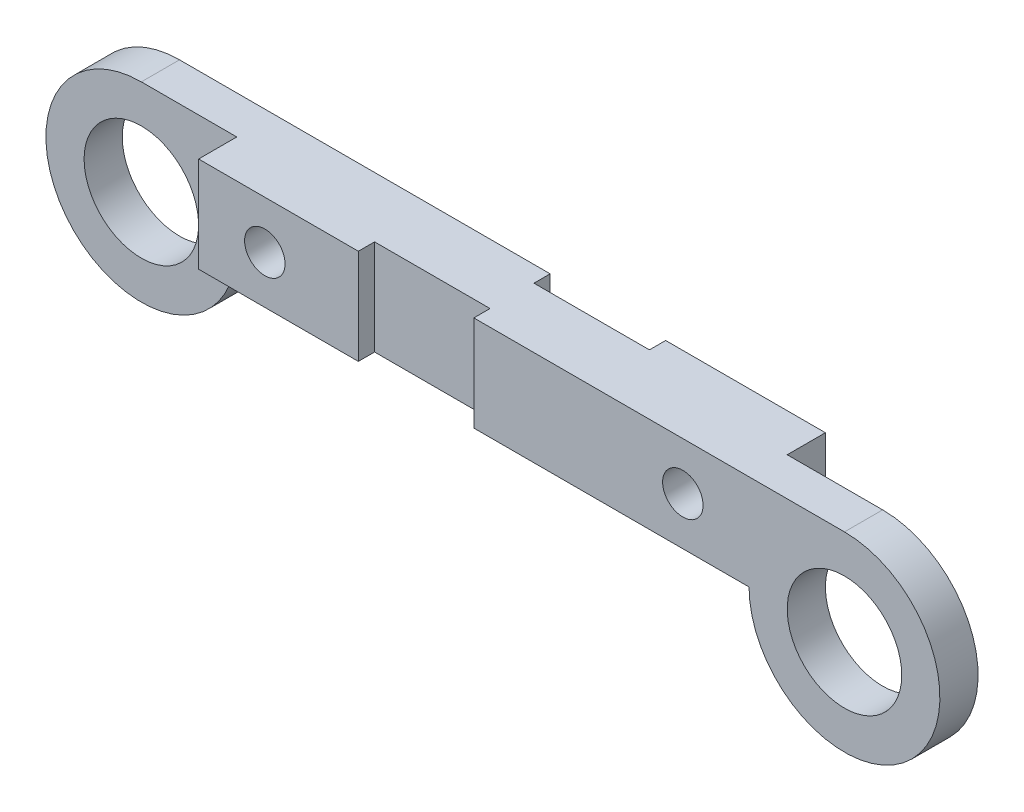
ISO-10303-21;
HEADER;
FILE_DESCRIPTION(('STEP AP214'),'2;1');
FILE_NAME('part.step','',(''),(''),'','','');
FILE_SCHEMA(('AUTOMOTIVE_DESIGN { 1 0 10303 214 1 1 1 1 }'));
ENDSEC;
DATA;
#1=APPLICATION_CONTEXT('core data for automotive mechanical design processes');
#2=APPLICATION_PROTOCOL_DEFINITION('international standard','automotive_design',2000,#1);
#3=PRODUCT_CONTEXT('',#1,'mechanical');
#4=PRODUCT('Part','Part','',(#3));
#5=PRODUCT_RELATED_PRODUCT_CATEGORY('part','',(#4));
#6=PRODUCT_DEFINITION_FORMATION('','',#4);
#7=PRODUCT_DEFINITION_CONTEXT('part definition',#1,'design');
#8=PRODUCT_DEFINITION('design','',#6,#7);
#9=PRODUCT_DEFINITION_SHAPE('','',#8);
#10=(LENGTH_UNIT() NAMED_UNIT(*) SI_UNIT(.MILLI.,.METRE.));
#11=(NAMED_UNIT(*) PLANE_ANGLE_UNIT() SI_UNIT($,.RADIAN.));
#12=(NAMED_UNIT(*) SI_UNIT($,.STERADIAN.) SOLID_ANGLE_UNIT());
#13=UNCERTAINTY_MEASURE_WITH_UNIT(LENGTH_MEASURE(1.E-05),#10,'distance_accuracy_value','');
#14=(GEOMETRIC_REPRESENTATION_CONTEXT(3) GLOBAL_UNCERTAINTY_ASSIGNED_CONTEXT((#13)) GLOBAL_UNIT_ASSIGNED_CONTEXT((#10,
#11,#12)) REPRESENTATION_CONTEXT('',''));
#15=CARTESIAN_POINT('',(0.,0.,0.));
#16=DIRECTION('',(0.,0.,1.));
#17=DIRECTION('',(1.,0.,0.));
#18=AXIS2_PLACEMENT_3D('',#15,#16,#17);
#19=CARTESIAN_POINT('',(-97.1,-25.,0.));
#20=DIRECTION('',(0.,0.,1.));
#21=DIRECTION('',(1.,0.,0.));
#22=AXIS2_PLACEMENT_3D('',#19,#20,#21);
#23=PLANE('',#22);
#24=CARTESIAN_POINT('',(-97.1,-25.,0.));
#25=DIRECTION('',(0.,0.,1.));
#26=DIRECTION('',(1.,0.,0.));
#27=AXIS2_PLACEMENT_3D('',#24,#25,#26);
#28=CIRCLE('',#27,15.);
#29=CARTESIAN_POINT('',(-82.1,-25.,0.));
#30=VERTEX_POINT('',#29);
#31=EDGE_CURVE('E255',#30,#30,#28,.T.);
#32=ORIENTED_EDGE('',*,*,#31,.T.);
#33=EDGE_LOOP('',(#32));
#34=FACE_BOUND('',#33,.T.);
#35=CARTESIAN_POINT('',(-54.7549646169727,-12.5,0.));
#36=DIRECTION('',(0.,0.,1.));
#37=DIRECTION('',(1.,0.,0.));
#38=AXIS2_PLACEMENT_3D('',#35,#36,#37);
#39=CIRCLE('',#38,5.29788538285587);
#40=CARTESIAN_POINT('',(-49.4570792341168,-12.5,0.));
#41=VERTEX_POINT('',#40);
#42=EDGE_CURVE('E220',#41,#41,#39,.F.);
#43=ORIENTED_EDGE('',*,*,#42,.F.);
#44=EDGE_LOOP('',(#43));
#45=FACE_BOUND('',#44,.T.);
#46=DIRECTION('',(-1.,0.,0.));
#47=VECTOR('',#46,1.);
#48=CARTESIAN_POINT('',(-97.1,0.,0.));
#49=LINE('',#48,#47);
#50=CARTESIAN_POINT('',(0.,0.,0.));
#51=VERTEX_POINT('',#50);
#52=CARTESIAN_POINT('',(-97.1,0.,0.));
#53=VERTEX_POINT('',#52);
#54=EDGE_CURVE('E276',#51,#53,#49,.T.);
#55=ORIENTED_EDGE('',*,*,#54,.F.);
#56=DIRECTION('',(0.,1.,0.));
#57=VECTOR('',#56,1.);
#58=CARTESIAN_POINT('',(0.,-31.,0.));
#59=LINE('',#58,#57);
#60=CARTESIAN_POINT('',(0.,-25.,0.));
#61=VERTEX_POINT('',#60);
#62=EDGE_CURVE('E178',#61,#51,#59,.T.);
#63=ORIENTED_EDGE('',*,*,#62,.F.);
#64=DIRECTION('',(1.,0.,0.));
#65=VECTOR('',#64,1.);
#66=CARTESIAN_POINT('',(-72.1,-25.,0.));
#67=LINE('',#66,#65);
#68=CARTESIAN_POINT('',(-72.1,-25.,0.));
#69=VERTEX_POINT('',#68);
#70=EDGE_CURVE('E273',#69,#61,#67,.T.);
#71=ORIENTED_EDGE('',*,*,#70,.F.);
#72=CARTESIAN_POINT('',(-97.1,-25.,0.));
#73=DIRECTION('',(0.,0.,1.));
#74=DIRECTION('',(1.,0.,0.));
#75=AXIS2_PLACEMENT_3D('',#72,#73,#74);
#76=CIRCLE('',#75,25.);
#77=EDGE_CURVE('E258',#53,#69,#76,.T.);
#78=ORIENTED_EDGE('',*,*,#77,.F.);
#79=EDGE_LOOP('',(#55,#63,#71,#78));
#80=FACE_BOUND('',#79,.T.);
#81=ADVANCED_FACE('F41',(#34,#45,#80),#23,.F.);
#82=CARTESIAN_POINT('',(-97.1,-25.,20.));
#83=DIRECTION('',(0.,0.,1.));
#84=DIRECTION('',(1.,0.,0.));
#85=AXIS2_PLACEMENT_3D('',#82,#83,#84);
#86=PLANE('',#85);
#87=DIRECTION('',(0.,1.,0.));
#88=VECTOR('',#87,1.);
#89=CARTESIAN_POINT('',(-30.2527430075511,-31.,20.));
#90=LINE('',#89,#88);
#91=CARTESIAN_POINT('',(-30.2527430075511,-25.,20.));
#92=VERTEX_POINT('',#91);
#93=CARTESIAN_POINT('',(-30.2527430075511,0.,20.));
#94=VERTEX_POINT('',#93);
#95=EDGE_CURVE('E194',#92,#94,#90,.T.);
#96=ORIENTED_EDGE('',*,*,#95,.T.);
#97=DIRECTION('',(-1.,0.,0.));
#98=VECTOR('',#97,1.);
#99=CARTESIAN_POINT('',(-97.1,0.,20.));
#100=LINE('',#99,#98);
#101=CARTESIAN_POINT('',(-72.1,0.,20.));
#102=VERTEX_POINT('',#101);
#103=EDGE_CURVE('E265',#94,#102,#100,.T.);
#104=ORIENTED_EDGE('',*,*,#103,.T.);
#105=DIRECTION('',(0.,1.,0.));
#106=VECTOR('',#105,1.);
#107=CARTESIAN_POINT('',(-72.1,-84.,20.));
#108=LINE('',#107,#106);
#109=CARTESIAN_POINT('',(-72.1,-25.,20.));
#110=VERTEX_POINT('',#109);
#111=EDGE_CURVE('E244',#110,#102,#108,.T.);
#112=ORIENTED_EDGE('',*,*,#111,.F.);
#113=DIRECTION('',(1.,0.,0.));
#114=VECTOR('',#113,1.);
#115=CARTESIAN_POINT('',(-72.1,-25.,20.));
#116=LINE('',#115,#114);
#117=EDGE_CURVE('E259',#110,#92,#116,.T.);
#118=ORIENTED_EDGE('',*,*,#117,.T.);
#119=EDGE_LOOP('',(#96,#104,#112,#118));
#120=FACE_BOUND('',#119,.T.);
#121=CARTESIAN_POINT('',(-54.7549646169727,-12.5,20.));
#122=DIRECTION('',(0.,0.,1.));
#123=DIRECTION('',(1.,0.,0.));
#124=AXIS2_PLACEMENT_3D('',#121,#122,#123);
#125=CIRCLE('',#124,5.29788538285587);
#126=CARTESIAN_POINT('',(-49.4570792341168,-12.5,20.));
#127=VERTEX_POINT('',#126);
#128=EDGE_CURVE('E217',#127,#127,#125,.T.);
#129=ORIENTED_EDGE('',*,*,#128,.F.);
#130=EDGE_LOOP('',(#129));
#131=FACE_BOUND('',#130,.T.);
#132=ADVANCED_FACE('F300',(#120,#131),#86,.T.);
#133=DIRECTION('',(0.,1.,0.));
#134=VECTOR('',#133,1.);
#135=CARTESIAN_POINT('',(0.,-31.,20.));
#136=LINE('',#135,#134);
#137=CARTESIAN_POINT('',(0.,-25.,20.));
#138=VERTEX_POINT('',#137);
#139=CARTESIAN_POINT('',(0.,0.,20.));
#140=VERTEX_POINT('',#139);
#141=EDGE_CURVE('E66',#138,#140,#136,.T.);
#142=ORIENTED_EDGE('',*,*,#141,.F.);
#143=CARTESIAN_POINT('',(72.1,-25.,20.));
#144=VERTEX_POINT('',#143);
#145=EDGE_CURVE('E263',#138,#144,#116,.T.);
#146=ORIENTED_EDGE('',*,*,#145,.T.);
#147=CARTESIAN_POINT('',(97.1,-25.,20.));
#148=DIRECTION('',(0.,0.,1.));
#149=DIRECTION('',(1.,0.,0.));
#150=AXIS2_PLACEMENT_3D('',#147,#148,#149);
#151=CIRCLE('',#150,25.);
#152=CARTESIAN_POINT('',(97.1,0.,20.));
#153=VERTEX_POINT('',#152);
#154=EDGE_CURVE('E262',#144,#153,#151,.T.);
#155=ORIENTED_EDGE('',*,*,#154,.T.);
#156=EDGE_CURVE('E266',#153,#140,#100,.T.);
#157=ORIENTED_EDGE('',*,*,#156,.T.);
#158=EDGE_LOOP('',(#142,#146,#155,#157));
#159=FACE_BOUND('',#158,.T.);
#160=CARTESIAN_POINT('',(54.7549646169727,-12.5,20.));
#161=DIRECTION('',(0.,0.,1.));
#162=DIRECTION('',(-1.,0.,0.));
#163=AXIS2_PLACEMENT_3D('',#160,#161,#162);
#164=CIRCLE('',#163,5.29788538285587);
#165=CARTESIAN_POINT('',(49.4570792341168,-12.5,20.));
#166=VERTEX_POINT('',#165);
#167=EDGE_CURVE('E211',#166,#166,#164,.T.);
#168=ORIENTED_EDGE('',*,*,#167,.F.);
#169=EDGE_LOOP('',(#168));
#170=FACE_BOUND('',#169,.T.);
#171=CARTESIAN_POINT('',(97.1,-25.,20.));
#172=DIRECTION('',(0.,0.,1.));
#173=DIRECTION('',(1.,0.,0.));
#174=AXIS2_PLACEMENT_3D('',#171,#172,#173);
#175=CIRCLE('',#174,15.);
#176=CARTESIAN_POINT('',(112.1,-25.,20.));
#177=VERTEX_POINT('',#176);
#178=EDGE_CURVE('E252',#177,#177,#175,.T.);
#179=ORIENTED_EDGE('',*,*,#178,.F.);
#180=EDGE_LOOP('',(#179));
#181=FACE_BOUND('',#180,.T.);
#182=ADVANCED_FACE('F334',(#159,#170,#181),#86,.T.);
#183=CARTESIAN_POINT('',(54.7549646169727,-12.5,0.));
#184=DIRECTION('',(0.,0.,1.));
#185=DIRECTION('',(1.,0.,0.));
#186=AXIS2_PLACEMENT_3D('',#183,#184,#185);
#187=CIRCLE('',#186,5.29788538285587);
#188=CARTESIAN_POINT('',(60.0528499998286,-12.5,0.));
#189=VERTEX_POINT('',#188);
#190=EDGE_CURVE('E214',#189,#189,#187,.F.);
#191=ORIENTED_EDGE('',*,*,#190,.F.);
#192=EDGE_LOOP('',(#191));
#193=FACE_BOUND('',#192,.T.);
#194=CARTESIAN_POINT('',(30.2527430075511,-25.,0.));
#195=VERTEX_POINT('',#194);
#196=CARTESIAN_POINT('',(72.1,-25.,0.));
#197=VERTEX_POINT('',#196);
#198=EDGE_CURVE('E272',#195,#197,#67,.T.);
#199=ORIENTED_EDGE('',*,*,#198,.F.);
#200=DIRECTION('',(0.,1.,0.));
#201=VECTOR('',#200,1.);
#202=CARTESIAN_POINT('',(30.2527430075511,-31.,0.));
#203=LINE('',#202,#201);
#204=CARTESIAN_POINT('',(30.2527430075511,0.,0.));
#205=VERTEX_POINT('',#204);
#206=EDGE_CURVE('E161',#195,#205,#203,.T.);
#207=ORIENTED_EDGE('',*,*,#206,.T.);
#208=CARTESIAN_POINT('',(72.1,0.,0.));
#209=VERTEX_POINT('',#208);
#210=EDGE_CURVE('E173',#209,#205,#49,.T.);
#211=ORIENTED_EDGE('',*,*,#210,.F.);
#212=DIRECTION('',(0.,1.,0.));
#213=VECTOR('',#212,1.);
#214=CARTESIAN_POINT('',(72.1,-84.,0.));
#215=LINE('',#214,#213);
#216=EDGE_CURVE('E229',#197,#209,#215,.T.);
#217=ORIENTED_EDGE('',*,*,#216,.F.);
#218=EDGE_LOOP('',(#199,#207,#211,#217));
#219=FACE_BOUND('',#218,.T.);
#220=ADVANCED_FACE('F302',(#193,#219),#23,.F.);
#221=CARTESIAN_POINT('',(-97.1,-25.,20.));
#222=DIRECTION('',(0.,0.,-1.));
#223=DIRECTION('',(-1.,0.,0.));
#224=AXIS2_PLACEMENT_3D('',#221,#222,#223);
#225=CYLINDRICAL_SURFACE('',#224,25.);
#226=CARTESIAN_POINT('',(-97.1,-25.,10.));
#227=DIRECTION('',(0.,0.,-1.));
#228=DIRECTION('',(-1.,0.,0.));
#229=AXIS2_PLACEMENT_3D('',#226,#227,#228);
#230=CIRCLE('',#229,25.);
#231=CARTESIAN_POINT('',(-72.1,-25.,10.));
#232=VERTEX_POINT('',#231);
#233=CARTESIAN_POINT('',(-97.1,0.,10.));
#234=VERTEX_POINT('',#233);
#235=EDGE_CURVE('E250',#232,#234,#230,.T.);
#236=ORIENTED_EDGE('',*,*,#235,.T.);
#237=DIRECTION('',(0.,0.,-1.));
#238=VECTOR('',#237,1.);
#239=CARTESIAN_POINT('',(-97.1,0.,20.));
#240=LINE('',#239,#238);
#241=EDGE_CURVE('E269',#234,#53,#240,.T.);
#242=ORIENTED_EDGE('',*,*,#241,.T.);
#243=ORIENTED_EDGE('',*,*,#77,.T.);
#244=DIRECTION('',(0.,0.,-1.));
#245=VECTOR('',#244,1.);
#246=CARTESIAN_POINT('',(-72.1,-25.,20.));
#247=LINE('',#246,#245);
#248=EDGE_CURVE('E50',#232,#69,#247,.T.);
#249=ORIENTED_EDGE('',*,*,#248,.F.);
#250=EDGE_LOOP('',(#236,#242,#243,#249));
#251=FACE_BOUND('',#250,.T.);
#252=ADVANCED_FACE('F43',(#251),#225,.T.);
#253=CARTESIAN_POINT('',(-72.1,-25.,20.));
#254=DIRECTION('',(0.,1.,0.));
#255=DIRECTION('',(0.,0.,1.));
#256=AXIS2_PLACEMENT_3D('',#253,#254,#255);
#257=PLANE('',#256);
#258=ORIENTED_EDGE('',*,*,#70,.T.);
#259=DIRECTION('',(0.,0.,1.));
#260=VECTOR('',#259,1.);
#261=CARTESIAN_POINT('',(0.,-25.,20.));
#262=LINE('',#261,#260);
#263=CARTESIAN_POINT('',(0.,-25.,4.24947860187063));
#264=VERTEX_POINT('',#263);
#265=EDGE_CURVE('E184',#61,#264,#262,.T.);
#266=ORIENTED_EDGE('',*,*,#265,.T.);
#267=DIRECTION('',(1.,0.,0.));
#268=VECTOR('',#267,1.);
#269=CARTESIAN_POINT('',(-72.1,-25.,4.24947860187063));
#270=LINE('',#269,#268);
#271=CARTESIAN_POINT('',(30.2527430075511,-25.,4.24947860187063));
#272=VERTEX_POINT('',#271);
#273=EDGE_CURVE('E180',#264,#272,#270,.T.);
#274=ORIENTED_EDGE('',*,*,#273,.T.);
#275=DIRECTION('',(0.,0.,-1.));
#276=VECTOR('',#275,1.);
#277=CARTESIAN_POINT('',(30.2527430075511,-25.,20.));
#278=LINE('',#277,#276);
#279=EDGE_CURVE('E158',#272,#195,#278,.T.);
#280=ORIENTED_EDGE('',*,*,#279,.T.);
#281=ORIENTED_EDGE('',*,*,#198,.T.);
#282=DIRECTION('',(0.,0.,-1.));
#283=VECTOR('',#282,1.);
#284=CARTESIAN_POINT('',(72.1,-25.,20.));
#285=LINE('',#284,#283);
#286=CARTESIAN_POINT('',(72.1,-25.,10.));
#287=VERTEX_POINT('',#286);
#288=EDGE_CURVE('E235',#287,#197,#285,.T.);
#289=ORIENTED_EDGE('',*,*,#288,.F.);
#290=DIRECTION('',(0.,0.,-1.));
#291=VECTOR('',#290,1.);
#292=CARTESIAN_POINT('',(72.1,-25.,20.));
#293=LINE('',#292,#291);
#294=EDGE_CURVE('E283',#144,#287,#293,.T.);
#295=ORIENTED_EDGE('',*,*,#294,.F.);
#296=ORIENTED_EDGE('',*,*,#145,.F.);
#297=DIRECTION('',(0.,0.,-1.));
#298=VECTOR('',#297,1.);
#299=CARTESIAN_POINT('',(0.,-25.,20.));
#300=LINE('',#299,#298);
#301=CARTESIAN_POINT('',(0.,-25.,15.7505213981294));
#302=VERTEX_POINT('',#301);
#303=EDGE_CURVE('E197',#138,#302,#300,.T.);
#304=ORIENTED_EDGE('',*,*,#303,.T.);
#305=DIRECTION('',(-1.,0.,0.));
#306=VECTOR('',#305,1.);
#307=CARTESIAN_POINT('',(-72.1,-25.,15.7505213981294));
#308=LINE('',#307,#306);
#309=CARTESIAN_POINT('',(-30.2527430075511,-25.,15.7505213981294));
#310=VERTEX_POINT('',#309);
#311=EDGE_CURVE('E205',#302,#310,#308,.T.);
#312=ORIENTED_EDGE('',*,*,#311,.T.);
#313=DIRECTION('',(0.,0.,1.));
#314=VECTOR('',#313,1.);
#315=CARTESIAN_POINT('',(-30.2527430075511,-25.,20.));
#316=LINE('',#315,#314);
#317=EDGE_CURVE('E208',#310,#92,#316,.T.);
#318=ORIENTED_EDGE('',*,*,#317,.T.);
#319=ORIENTED_EDGE('',*,*,#117,.F.);
#320=EDGE_CURVE('E11',#110,#232,#247,.T.);
#321=ORIENTED_EDGE('',*,*,#320,.T.);
#322=ORIENTED_EDGE('',*,*,#248,.T.);
#323=EDGE_LOOP('',(#258,#266,#274,#280,#281,#289,#295,#296,#304,#312,#318,#319,#321,#322));
#324=FACE_BOUND('',#323,.T.);
#325=ADVANCED_FACE('F324',(#324),#257,.F.);
#326=CARTESIAN_POINT('',(97.1,-25.,20.));
#327=DIRECTION('',(0.,0.,-1.));
#328=DIRECTION('',(-1.,0.,0.));
#329=AXIS2_PLACEMENT_3D('',#326,#327,#328);
#330=CYLINDRICAL_SURFACE('',#329,25.);
#331=CARTESIAN_POINT('',(97.1,-25.,10.));
#332=DIRECTION('',(0.,0.,1.));
#333=DIRECTION('',(1.,0.,0.));
#334=AXIS2_PLACEMENT_3D('',#331,#332,#333);
#335=CIRCLE('',#334,25.);
#336=CARTESIAN_POINT('',(97.1,0.,10.));
#337=VERTEX_POINT('',#336);
#338=EDGE_CURVE('E233',#287,#337,#335,.T.);
#339=ORIENTED_EDGE('',*,*,#338,.T.);
#340=DIRECTION('',(0.,0.,-1.));
#341=VECTOR('',#340,1.);
#342=CARTESIAN_POINT('',(97.1,0.,20.));
#343=LINE('',#342,#341);
#344=EDGE_CURVE('E280',#153,#337,#343,.T.);
#345=ORIENTED_EDGE('',*,*,#344,.F.);
#346=ORIENTED_EDGE('',*,*,#154,.F.);
#347=ORIENTED_EDGE('',*,*,#294,.T.);
#348=EDGE_LOOP('',(#339,#345,#346,#347));
#349=FACE_BOUND('',#348,.T.);
#350=ADVANCED_FACE('F341',(#349),#330,.T.);
#351=CARTESIAN_POINT('',(-97.1,0.,20.));
#352=DIRECTION('',(0.,-1.,0.));
#353=DIRECTION('',(1.,0.,0.));
#354=AXIS2_PLACEMENT_3D('',#351,#352,#353);
#355=PLANE('',#354);
#356=DIRECTION('',(1.,0.,0.));
#357=VECTOR('',#356,1.);
#358=CARTESIAN_POINT('',(0.,0.,4.24947860187063));
#359=LINE('',#358,#357);
#360=CARTESIAN_POINT('',(0.,0.,4.24947860187063));
#361=VERTEX_POINT('',#360);
#362=CARTESIAN_POINT('',(30.2527430075511,0.,4.24947860187063));
#363=VERTEX_POINT('',#362);
#364=EDGE_CURVE('E165',#361,#363,#359,.T.);
#365=ORIENTED_EDGE('',*,*,#364,.F.);
#366=DIRECTION('',(0.,0.,1.));
#367=VECTOR('',#366,1.);
#368=CARTESIAN_POINT('',(0.,0.,4.24947860187063));
#369=LINE('',#368,#367);
#370=EDGE_CURVE('E58',#51,#361,#369,.T.);
#371=ORIENTED_EDGE('',*,*,#370,.F.);
#372=ORIENTED_EDGE('',*,*,#54,.T.);
#373=ORIENTED_EDGE('',*,*,#241,.F.);
#374=DIRECTION('',(-1.,0.,0.));
#375=VECTOR('',#374,1.);
#376=CARTESIAN_POINT('',(-122.1,0.,10.));
#377=LINE('',#376,#375);
#378=CARTESIAN_POINT('',(-72.1,0.,10.));
#379=VERTEX_POINT('',#378);
#380=EDGE_CURVE('E241',#379,#234,#377,.T.);
#381=ORIENTED_EDGE('',*,*,#380,.F.);
#382=DIRECTION('',(0.,0.,-1.));
#383=VECTOR('',#382,1.);
#384=CARTESIAN_POINT('',(-72.1,0.,20.));
#385=LINE('',#384,#383);
#386=EDGE_CURVE('E238',#102,#379,#385,.T.);
#387=ORIENTED_EDGE('',*,*,#386,.F.);
#388=ORIENTED_EDGE('',*,*,#103,.F.);
#389=DIRECTION('',(0.,0.,1.));
#390=VECTOR('',#389,1.);
#391=CARTESIAN_POINT('',(-30.2527430075511,0.,20.));
#392=LINE('',#391,#390);
#393=CARTESIAN_POINT('',(-30.2527430075511,0.,15.7505213981294));
#394=VERTEX_POINT('',#393);
#395=EDGE_CURVE('E187',#394,#94,#392,.T.);
#396=ORIENTED_EDGE('',*,*,#395,.F.);
#397=DIRECTION('',(-1.,0.,0.));
#398=VECTOR('',#397,1.);
#399=CARTESIAN_POINT('',(-30.2527430075511,0.,15.7505213981294));
#400=LINE('',#399,#398);
#401=CARTESIAN_POINT('',(0.,0.,15.7505213981294));
#402=VERTEX_POINT('',#401);
#403=EDGE_CURVE('E191',#402,#394,#400,.T.);
#404=ORIENTED_EDGE('',*,*,#403,.F.);
#405=DIRECTION('',(0.,0.,-1.));
#406=VECTOR('',#405,1.);
#407=CARTESIAN_POINT('',(0.,0.,20.));
#408=LINE('',#407,#406);
#409=EDGE_CURVE('E189',#140,#402,#408,.T.);
#410=ORIENTED_EDGE('',*,*,#409,.F.);
#411=ORIENTED_EDGE('',*,*,#156,.F.);
#412=ORIENTED_EDGE('',*,*,#344,.T.);
#413=DIRECTION('',(1.,0.,0.));
#414=VECTOR('',#413,1.);
#415=CARTESIAN_POINT('',(72.1,0.,10.));
#416=LINE('',#415,#414);
#417=CARTESIAN_POINT('',(72.1,0.,10.));
#418=VERTEX_POINT('',#417);
#419=EDGE_CURVE('E225',#418,#337,#416,.T.);
#420=ORIENTED_EDGE('',*,*,#419,.F.);
#421=DIRECTION('',(0.,0.,1.));
#422=VECTOR('',#421,1.);
#423=CARTESIAN_POINT('',(72.1,0.,0.));
#424=LINE('',#423,#422);
#425=EDGE_CURVE('E223',#209,#418,#424,.T.);
#426=ORIENTED_EDGE('',*,*,#425,.F.);
#427=ORIENTED_EDGE('',*,*,#210,.T.);
#428=DIRECTION('',(0.,0.,-1.));
#429=VECTOR('',#428,1.);
#430=CARTESIAN_POINT('',(30.2527430075511,0.,4.24947860187063));
#431=LINE('',#430,#429);
#432=EDGE_CURVE('E155',#363,#205,#431,.T.);
#433=ORIENTED_EDGE('',*,*,#432,.F.);
#434=EDGE_LOOP('',(#365,#371,#372,#373,#381,#387,#388,#396,#404,#410,#411,#412,#420,#426,#427,#433));
#435=FACE_BOUND('',#434,.T.);
#436=ADVANCED_FACE('F170',(#435),#355,.F.);
#437=CARTESIAN_POINT('',(-97.1,-25.,20.));
#438=DIRECTION('',(0.,0.,-1.));
#439=DIRECTION('',(-1.,0.,0.));
#440=AXIS2_PLACEMENT_3D('',#437,#438,#439);
#441=CYLINDRICAL_SURFACE('',#440,15.);
#442=CARTESIAN_POINT('',(-97.1,-25.,10.));
#443=DIRECTION('',(0.,0.,-1.));
#444=DIRECTION('',(-1.,0.,0.));
#445=AXIS2_PLACEMENT_3D('',#442,#443,#444);
#446=CIRCLE('',#445,15.);
#447=CARTESIAN_POINT('',(-112.1,-25.,10.));
#448=VERTEX_POINT('',#447);
#449=EDGE_CURVE('E247',#448,#448,#446,.T.);
#450=ORIENTED_EDGE('',*,*,#449,.F.);
#451=EDGE_LOOP('',(#450));
#452=FACE_BOUND('',#451,.T.);
#453=ORIENTED_EDGE('',*,*,#31,.F.);
#454=EDGE_LOOP('',(#453));
#455=FACE_BOUND('',#454,.T.);
#456=ADVANCED_FACE('F291',(#452,#455),#441,.F.);
#457=CARTESIAN_POINT('',(97.1,-25.,20.));
#458=DIRECTION('',(0.,0.,-1.));
#459=DIRECTION('',(-1.,0.,0.));
#460=AXIS2_PLACEMENT_3D('',#457,#458,#459);
#461=CYLINDRICAL_SURFACE('',#460,15.);
#462=CARTESIAN_POINT('',(97.1,-25.,10.));
#463=DIRECTION('',(0.,0.,1.));
#464=DIRECTION('',(1.,0.,0.));
#465=AXIS2_PLACEMENT_3D('',#462,#463,#464);
#466=CIRCLE('',#465,15.);
#467=CARTESIAN_POINT('',(112.1,-25.,10.));
#468=VERTEX_POINT('',#467);
#469=EDGE_CURVE('E45',#468,#468,#466,.T.);
#470=ORIENTED_EDGE('',*,*,#469,.F.);
#471=EDGE_LOOP('',(#470));
#472=FACE_BOUND('',#471,.T.);
#473=ORIENTED_EDGE('',*,*,#178,.T.);
#474=EDGE_LOOP('',(#473));
#475=FACE_BOUND('',#474,.T.);
#476=ADVANCED_FACE('F294',(#472,#475),#461,.F.);
#477=CARTESIAN_POINT('',(-72.1,-84.,20.));
#478=DIRECTION('',(1.,0.,0.));
#479=DIRECTION('',(0.,1.,0.));
#480=AXIS2_PLACEMENT_3D('',#477,#478,#479);
#481=PLANE('',#480);
#482=ORIENTED_EDGE('',*,*,#111,.T.);
#483=ORIENTED_EDGE('',*,*,#386,.T.);
#484=DIRECTION('',(0.,1.,0.));
#485=VECTOR('',#484,1.);
#486=CARTESIAN_POINT('',(-72.1,-84.,10.));
#487=LINE('',#486,#485);
#488=EDGE_CURVE('E245',#232,#379,#487,.T.);
#489=ORIENTED_EDGE('',*,*,#488,.F.);
#490=ORIENTED_EDGE('',*,*,#320,.F.);
#491=EDGE_LOOP('',(#482,#483,#489,#490));
#492=FACE_BOUND('',#491,.T.);
#493=ADVANCED_FACE('F318',(#492),#481,.F.);
#494=CARTESIAN_POINT('',(-122.1,-84.,10.));
#495=DIRECTION('',(0.,0.,-1.));
#496=DIRECTION('',(-1.,0.,0.));
#497=AXIS2_PLACEMENT_3D('',#494,#495,#496);
#498=PLANE('',#497);
#499=ORIENTED_EDGE('',*,*,#449,.T.);
#500=EDGE_LOOP('',(#499));
#501=FACE_BOUND('',#500,.T.);
#502=ORIENTED_EDGE('',*,*,#235,.F.);
#503=ORIENTED_EDGE('',*,*,#488,.T.);
#504=ORIENTED_EDGE('',*,*,#380,.T.);
#505=EDGE_LOOP('',(#502,#503,#504));
#506=FACE_BOUND('',#505,.T.);
#507=ADVANCED_FACE('F288',(#501,#506),#498,.F.);
#508=CARTESIAN_POINT('',(72.1,-84.,10.));
#509=DIRECTION('',(0.,0.,1.));
#510=DIRECTION('',(1.,0.,0.));
#511=AXIS2_PLACEMENT_3D('',#508,#509,#510);
#512=PLANE('',#511);
#513=ORIENTED_EDGE('',*,*,#469,.T.);
#514=EDGE_LOOP('',(#513));
#515=FACE_BOUND('',#514,.T.);
#516=ORIENTED_EDGE('',*,*,#338,.F.);
#517=DIRECTION('',(0.,1.,0.));
#518=VECTOR('',#517,1.);
#519=CARTESIAN_POINT('',(72.1,-84.,10.));
#520=LINE('',#519,#518);
#521=EDGE_CURVE('E228',#287,#418,#520,.T.);
#522=ORIENTED_EDGE('',*,*,#521,.T.);
#523=ORIENTED_EDGE('',*,*,#419,.T.);
#524=EDGE_LOOP('',(#516,#522,#523));
#525=FACE_BOUND('',#524,.T.);
#526=ADVANCED_FACE('F344',(#515,#525),#512,.F.);
#527=CARTESIAN_POINT('',(72.1,-84.,0.));
#528=DIRECTION('',(-1.,0.,0.));
#529=DIRECTION('',(0.,-1.,0.));
#530=AXIS2_PLACEMENT_3D('',#527,#528,#529);
#531=PLANE('',#530);
#532=ORIENTED_EDGE('',*,*,#288,.T.);
#533=ORIENTED_EDGE('',*,*,#216,.T.);
#534=ORIENTED_EDGE('',*,*,#425,.T.);
#535=ORIENTED_EDGE('',*,*,#521,.F.);
#536=EDGE_LOOP('',(#532,#533,#534,#535));
#537=FACE_BOUND('',#536,.T.);
#538=ADVANCED_FACE('F348',(#537),#531,.F.);
#539=CARTESIAN_POINT('',(-54.7549646169727,-12.5,-14.9846827206659));
#540=DIRECTION('',(0.,0.,1.));
#541=DIRECTION('',(1.,0.,0.));
#542=AXIS2_PLACEMENT_3D('',#539,#540,#541);
#543=CYLINDRICAL_SURFACE('',#542,5.29788538285587);
#544=ORIENTED_EDGE('',*,*,#42,.T.);
#545=EDGE_LOOP('',(#544));
#546=FACE_BOUND('',#545,.T.);
#547=ORIENTED_EDGE('',*,*,#128,.T.);
#548=EDGE_LOOP('',(#547));
#549=FACE_BOUND('',#548,.T.);
#550=ADVANCED_FACE('F419',(#546,#549),#543,.F.);
#551=CARTESIAN_POINT('',(54.7549646169727,-12.5,-14.9846827206659));
#552=DIRECTION('',(0.,0.,1.));
#553=DIRECTION('',(1.,0.,0.));
#554=AXIS2_PLACEMENT_3D('',#551,#552,#553);
#555=CYLINDRICAL_SURFACE('',#554,5.29788538285587);
#556=ORIENTED_EDGE('',*,*,#190,.T.);
#557=EDGE_LOOP('',(#556));
#558=FACE_BOUND('',#557,.T.);
#559=ORIENTED_EDGE('',*,*,#167,.T.);
#560=EDGE_LOOP('',(#559));
#561=FACE_BOUND('',#560,.T.);
#562=ADVANCED_FACE('F380',(#558,#561),#555,.F.);
#563=CARTESIAN_POINT('',(-30.2527430075511,-31.,20.));
#564=DIRECTION('',(-1.,0.,0.));
#565=DIRECTION('',(0.,-1.,0.));
#566=AXIS2_PLACEMENT_3D('',#563,#564,#565);
#567=PLANE('',#566);
#568=DIRECTION('',(0.,1.,0.));
#569=VECTOR('',#568,1.);
#570=CARTESIAN_POINT('',(-30.2527430075511,-31.,15.7505213981294));
#571=LINE('',#570,#569);
#572=EDGE_CURVE('E195',#310,#394,#571,.T.);
#573=ORIENTED_EDGE('',*,*,#572,.T.);
#574=ORIENTED_EDGE('',*,*,#395,.T.);
#575=ORIENTED_EDGE('',*,*,#95,.F.);
#576=ORIENTED_EDGE('',*,*,#317,.F.);
#577=EDGE_LOOP('',(#573,#574,#575,#576));
#578=FACE_BOUND('',#577,.T.);
#579=ADVANCED_FACE('F327',(#578),#567,.F.);
#580=CARTESIAN_POINT('',(-30.2527430075511,-31.,15.7505213981294));
#581=DIRECTION('',(0.,0.,-1.));
#582=DIRECTION('',(-1.,0.,0.));
#583=AXIS2_PLACEMENT_3D('',#580,#581,#582);
#584=PLANE('',#583);
#585=DIRECTION('',(0.,1.,0.));
#586=VECTOR('',#585,1.);
#587=CARTESIAN_POINT('',(0.,-31.,15.7505213981294));
#588=LINE('',#587,#586);
#589=EDGE_CURVE('E198',#302,#402,#588,.T.);
#590=ORIENTED_EDGE('',*,*,#589,.T.);
#591=ORIENTED_EDGE('',*,*,#403,.T.);
#592=ORIENTED_EDGE('',*,*,#572,.F.);
#593=ORIENTED_EDGE('',*,*,#311,.F.);
#594=EDGE_LOOP('',(#590,#591,#592,#593));
#595=FACE_BOUND('',#594,.T.);
#596=ADVANCED_FACE('F329',(#595),#584,.F.);
#597=CARTESIAN_POINT('',(0.,-31.,20.));
#598=DIRECTION('',(1.,0.,0.));
#599=DIRECTION('',(0.,1.,0.));
#600=AXIS2_PLACEMENT_3D('',#597,#598,#599);
#601=PLANE('',#600);
#602=ORIENTED_EDGE('',*,*,#141,.T.);
#603=ORIENTED_EDGE('',*,*,#409,.T.);
#604=ORIENTED_EDGE('',*,*,#589,.F.);
#605=ORIENTED_EDGE('',*,*,#303,.F.);
#606=EDGE_LOOP('',(#602,#603,#604,#605));
#607=FACE_BOUND('',#606,.T.);
#608=ADVANCED_FACE('F388',(#607),#601,.F.);
#609=CARTESIAN_POINT('',(0.,-31.,4.24947860187063));
#610=DIRECTION('',(-1.,0.,0.));
#611=DIRECTION('',(0.,-1.,0.));
#612=AXIS2_PLACEMENT_3D('',#609,#610,#611);
#613=PLANE('',#612);
#614=ORIENTED_EDGE('',*,*,#62,.T.);
#615=ORIENTED_EDGE('',*,*,#370,.T.);
#616=DIRECTION('',(0.,1.,0.));
#617=VECTOR('',#616,1.);
#618=CARTESIAN_POINT('',(0.,-31.,4.24947860187063));
#619=LINE('',#618,#617);
#620=EDGE_CURVE('E162',#264,#361,#619,.T.);
#621=ORIENTED_EDGE('',*,*,#620,.F.);
#622=ORIENTED_EDGE('',*,*,#265,.F.);
#623=EDGE_LOOP('',(#614,#615,#621,#622));
#624=FACE_BOUND('',#623,.T.);
#625=ADVANCED_FACE('F395',(#624),#613,.F.);
#626=CARTESIAN_POINT('',(30.2527430075511,-31.,4.24947860187063));
#627=DIRECTION('',(1.,0.,0.));
#628=DIRECTION('',(0.,1.,0.));
#629=AXIS2_PLACEMENT_3D('',#626,#627,#628);
#630=PLANE('',#629);
#631=DIRECTION('',(0.,1.,0.));
#632=VECTOR('',#631,1.);
#633=CARTESIAN_POINT('',(30.2527430075511,-31.,4.24947860187063));
#634=LINE('',#633,#632);
#635=EDGE_CURVE('E151',#272,#363,#634,.T.);
#636=ORIENTED_EDGE('',*,*,#635,.T.);
#637=ORIENTED_EDGE('',*,*,#432,.T.);
#638=ORIENTED_EDGE('',*,*,#206,.F.);
#639=ORIENTED_EDGE('',*,*,#279,.F.);
#640=EDGE_LOOP('',(#636,#637,#638,#639));
#641=FACE_BOUND('',#640,.T.);
#642=ADVANCED_FACE('F153',(#641),#630,.F.);
#643=CARTESIAN_POINT('',(0.,-31.,4.24947860187063));
#644=DIRECTION('',(0.,0.,1.));
#645=DIRECTION('',(1.,0.,0.));
#646=AXIS2_PLACEMENT_3D('',#643,#644,#645);
#647=PLANE('',#646);
#648=ORIENTED_EDGE('',*,*,#620,.T.);
#649=ORIENTED_EDGE('',*,*,#364,.T.);
#650=ORIENTED_EDGE('',*,*,#635,.F.);
#651=ORIENTED_EDGE('',*,*,#273,.F.);
#652=EDGE_LOOP('',(#648,#649,#650,#651));
#653=FACE_BOUND('',#652,.T.);
#654=ADVANCED_FACE('F166',(#653),#647,.F.);
#655=CLOSED_SHELL('',(#81,#132,#182,#220,#252,#325,#350,#436,#456,#476,#493,#507,#526,#538,#550,
#562,#579,#596,#608,#625,#642,#654));
#656=MANIFOLD_SOLID_BREP('B2',#655);
#657=ADVANCED_BREP_SHAPE_REPRESENTATION('',(#18,#656),#14);
#658=SHAPE_DEFINITION_REPRESENTATION(#9,#657);
ENDSEC;
END-ISO-10303-21;
